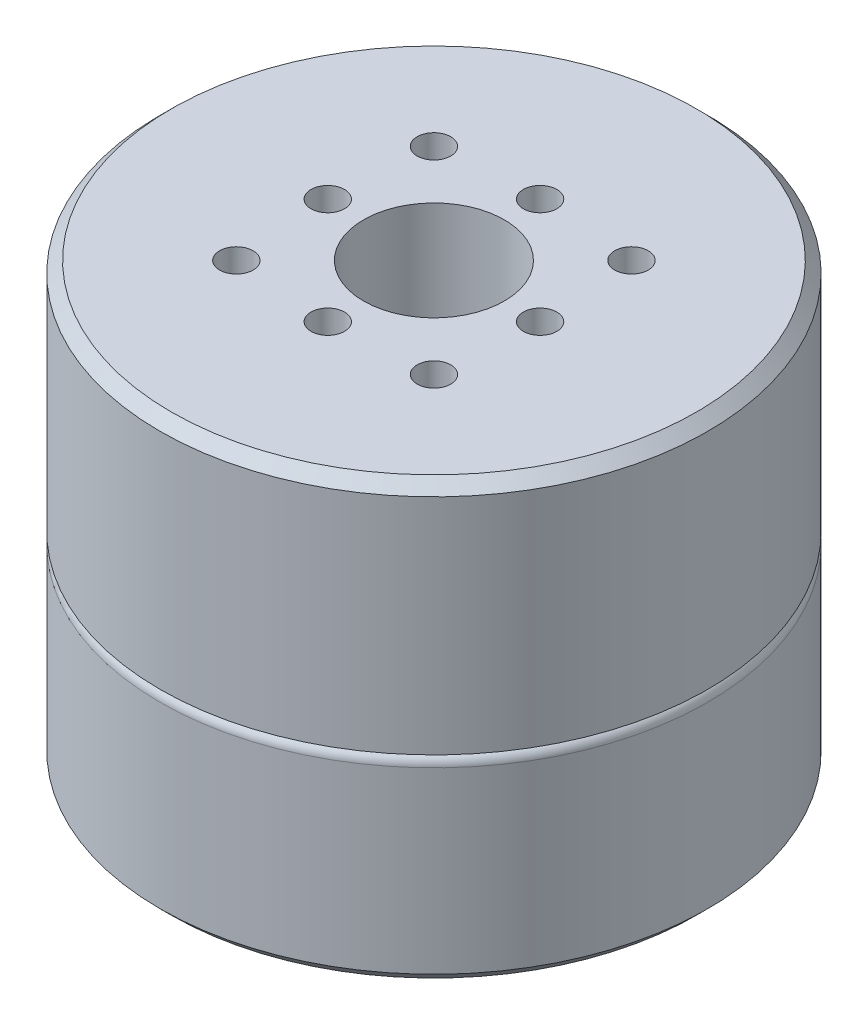
ISO-10303-21;
HEADER;
FILE_DESCRIPTION(('STEP AP214'),'2;1');
FILE_NAME('part.step','',(''),(''),'','','');
FILE_SCHEMA(('AUTOMOTIVE_DESIGN { 1 0 10303 214 1 1 1 1 }'));
ENDSEC;
DATA;
#1=APPLICATION_CONTEXT('core data for automotive mechanical design processes');
#2=APPLICATION_PROTOCOL_DEFINITION('international standard','automotive_design',2000,#1);
#3=PRODUCT_CONTEXT('',#1,'mechanical');
#4=PRODUCT('Part','Part','',(#3));
#5=PRODUCT_RELATED_PRODUCT_CATEGORY('part','',(#4));
#6=PRODUCT_DEFINITION_FORMATION('','',#4);
#7=PRODUCT_DEFINITION_CONTEXT('part definition',#1,'design');
#8=PRODUCT_DEFINITION('design','',#6,#7);
#9=PRODUCT_DEFINITION_SHAPE('','',#8);
#10=(LENGTH_UNIT() NAMED_UNIT(*) SI_UNIT(.MILLI.,.METRE.));
#11=(NAMED_UNIT(*) PLANE_ANGLE_UNIT() SI_UNIT($,.RADIAN.));
#12=(NAMED_UNIT(*) SI_UNIT($,.STERADIAN.) SOLID_ANGLE_UNIT());
#13=UNCERTAINTY_MEASURE_WITH_UNIT(LENGTH_MEASURE(1.E-05),#10,'distance_accuracy_value','');
#14=(GEOMETRIC_REPRESENTATION_CONTEXT(3) GLOBAL_UNCERTAINTY_ASSIGNED_CONTEXT((#13)) GLOBAL_UNIT_ASSIGNED_CONTEXT((#10,
#11,#12)) REPRESENTATION_CONTEXT('',''));
#15=CARTESIAN_POINT('',(0.,0.,0.));
#16=DIRECTION('',(0.,0.,1.));
#17=DIRECTION('',(1.,0.,0.));
#18=AXIS2_PLACEMENT_3D('',#15,#16,#17);
#19=CARTESIAN_POINT('',(0.,18.,0.));
#20=DIRECTION('',(0.,-1.,0.));
#21=DIRECTION('',(0.,0.,-1.));
#22=AXIS2_PLACEMENT_3D('',#19,#20,#21);
#23=CYLINDRICAL_SURFACE('',#22,24.5);
#24=CARTESIAN_POINT('',(0.,1.,0.));
#25=DIRECTION('',(0.,1.,0.));
#26=DIRECTION('',(0.,0.,1.));
#27=AXIS2_PLACEMENT_3D('',#24,#25,#26);
#28=CIRCLE('',#27,24.5);
#29=CARTESIAN_POINT('',(0.,1.,24.5));
#30=VERTEX_POINT('',#29);
#31=EDGE_CURVE('E44',#30,#30,#28,.T.);
#32=ORIENTED_EDGE('',*,*,#31,.T.);
#33=EDGE_LOOP('',(#32));
#34=FACE_BOUND('',#33,.T.);
#35=CARTESIAN_POINT('',(0.,17.,0.));
#36=DIRECTION('',(0.,1.,0.));
#37=DIRECTION('',(0.,0.,1.));
#38=AXIS2_PLACEMENT_3D('',#35,#36,#37);
#39=CIRCLE('',#38,24.5);
#40=CARTESIAN_POINT('',(0.,17.,24.5));
#41=VERTEX_POINT('',#40);
#42=EDGE_CURVE('E57',#41,#41,#39,.F.);
#43=ORIENTED_EDGE('',*,*,#42,.T.);
#44=EDGE_LOOP('',(#43));
#45=FACE_BOUND('',#44,.T.);
#46=ADVANCED_FACE('F36',(#34,#45),#23,.T.);
#47=CARTESIAN_POINT('',(0.,0.,0.));
#48=DIRECTION('',(0.,1.,0.));
#49=DIRECTION('',(0.,0.,1.));
#50=AXIS2_PLACEMENT_3D('',#47,#48,#49);
#51=PLANE('',#50);
#52=CARTESIAN_POINT('',(15.,0.,0.));
#53=DIRECTION('',(0.,-1.,0.));
#54=DIRECTION('',(0.,0.,-1.));
#55=AXIS2_PLACEMENT_3D('',#52,#53,#54);
#56=CIRCLE('',#55,1.5);
#57=CARTESIAN_POINT('',(15.,0.,-1.5));
#58=VERTEX_POINT('',#57);
#59=EDGE_CURVE('E139',#58,#58,#56,.T.);
#60=ORIENTED_EDGE('',*,*,#59,.F.);
#61=EDGE_LOOP('',(#60));
#62=FACE_BOUND('',#61,.T.);
#63=CARTESIAN_POINT('',(0.,0.,-15.));
#64=DIRECTION('',(0.,-1.,0.));
#65=DIRECTION('',(0.,0.,-1.));
#66=AXIS2_PLACEMENT_3D('',#63,#64,#65);
#67=CIRCLE('',#66,1.5);
#68=CARTESIAN_POINT('',(0.,0.,-16.5));
#69=VERTEX_POINT('',#68);
#70=EDGE_CURVE('E133',#69,#69,#67,.T.);
#71=ORIENTED_EDGE('',*,*,#70,.F.);
#72=EDGE_LOOP('',(#71));
#73=FACE_BOUND('',#72,.T.);
#74=CARTESIAN_POINT('',(-15.,0.,1.04744440165294E-13));
#75=DIRECTION('',(0.,-1.,0.));
#76=DIRECTION('',(0.,0.,-1.));
#77=AXIS2_PLACEMENT_3D('',#74,#75,#76);
#78=CIRCLE('',#77,1.5);
#79=CARTESIAN_POINT('',(-15.,0.,-1.4999999999999));
#80=VERTEX_POINT('',#79);
#81=EDGE_CURVE('E127',#80,#80,#78,.T.);
#82=ORIENTED_EDGE('',*,*,#81,.F.);
#83=EDGE_LOOP('',(#82));
#84=FACE_BOUND('',#83,.T.);
#85=CARTESIAN_POINT('',(1.57116660247941E-13,0.,15.));
#86=DIRECTION('',(0.,-1.,0.));
#87=DIRECTION('',(0.,0.,-1.));
#88=AXIS2_PLACEMENT_3D('',#85,#86,#87);
#89=CIRCLE('',#88,1.5);
#90=CARTESIAN_POINT('',(1.57116660247941E-13,0.,13.5));
#91=VERTEX_POINT('',#90);
#92=EDGE_CURVE('E121',#91,#91,#89,.T.);
#93=ORIENTED_EDGE('',*,*,#92,.F.);
#94=EDGE_LOOP('',(#93));
#95=FACE_BOUND('',#94,.T.);
#96=CARTESIAN_POINT('',(0.,0.,0.));
#97=DIRECTION('',(0.,1.,0.));
#98=DIRECTION('',(0.,0.,1.));
#99=AXIS2_PLACEMENT_3D('',#96,#97,#98);
#100=CIRCLE('',#99,23.5);
#101=CARTESIAN_POINT('',(0.,0.,23.5));
#102=VERTEX_POINT('',#101);
#103=EDGE_CURVE('E10',#102,#102,#100,.F.);
#104=ORIENTED_EDGE('',*,*,#103,.T.);
#105=EDGE_LOOP('',(#104));
#106=FACE_BOUND('',#105,.T.);
#107=ADVANCED_FACE('F154',(#62,#73,#84,#95,#106),#51,.F.);
#108=CARTESIAN_POINT('',(0.,17.,0.));
#109=DIRECTION('',(0.,1.,0.));
#110=DIRECTION('',(0.,0.,1.));
#111=AXIS2_PLACEMENT_3D('',#108,#109,#110);
#112=TOROIDAL_SURFACE('',#111,23.5,1.);
#113=ORIENTED_EDGE('',*,*,#42,.F.);
#114=EDGE_LOOP('',(#113));
#115=FACE_BOUND('',#114,.T.);
#116=CARTESIAN_POINT('',(0.,18.,0.));
#117=DIRECTION('',(0.,1.,0.));
#118=DIRECTION('',(0.,0.,1.));
#119=AXIS2_PLACEMENT_3D('',#116,#117,#118);
#120=CIRCLE('',#119,23.5);
#121=CARTESIAN_POINT('',(0.,18.,23.5));
#122=VERTEX_POINT('',#121);
#123=EDGE_CURVE('E60',#122,#122,#120,.T.);
#124=ORIENTED_EDGE('',*,*,#123,.F.);
#125=EDGE_LOOP('',(#124));
#126=FACE_BOUND('',#125,.T.);
#127=ADVANCED_FACE('F157',(#115,#126),#112,.T.);
#128=CARTESIAN_POINT('',(0.,39.,0.));
#129=DIRECTION('',(0.,-1.,0.));
#130=DIRECTION('',(0.,0.,-1.));
#131=AXIS2_PLACEMENT_3D('',#128,#129,#130);
#132=CYLINDRICAL_SURFACE('',#131,24.5);
#133=CARTESIAN_POINT('',(0.,38.,0.));
#134=DIRECTION('',(0.,1.,0.));
#135=DIRECTION('',(0.,0.,1.));
#136=AXIS2_PLACEMENT_3D('',#133,#134,#135);
#137=CIRCLE('',#136,24.5);
#138=CARTESIAN_POINT('',(0.,38.,24.5));
#139=VERTEX_POINT('',#138);
#140=EDGE_CURVE('E48',#139,#139,#137,.F.);
#141=ORIENTED_EDGE('',*,*,#140,.T.);
#142=EDGE_LOOP('',(#141));
#143=FACE_BOUND('',#142,.T.);
#144=CARTESIAN_POINT('',(0.,18.,0.));
#145=DIRECTION('',(0.,1.,0.));
#146=DIRECTION('',(0.,0.,1.));
#147=AXIS2_PLACEMENT_3D('',#144,#145,#146);
#148=CIRCLE('',#147,24.5);
#149=CARTESIAN_POINT('',(0.,18.,24.5));
#150=VERTEX_POINT('',#149);
#151=EDGE_CURVE('E63',#150,#150,#148,.T.);
#152=ORIENTED_EDGE('',*,*,#151,.T.);
#153=EDGE_LOOP('',(#152));
#154=FACE_BOUND('',#153,.T.);
#155=ADVANCED_FACE('F191',(#143,#154),#132,.T.);
#156=CARTESIAN_POINT('',(0.,39.,0.));
#157=DIRECTION('',(0.,1.,0.));
#158=DIRECTION('',(0.,0.,1.));
#159=AXIS2_PLACEMENT_3D('',#156,#157,#158);
#160=PLANE('',#159);
#161=CARTESIAN_POINT('',(0.,39.,9.5));
#162=DIRECTION('',(0.,1.,0.));
#163=DIRECTION('',(0.,0.,1.));
#164=AXIS2_PLACEMENT_3D('',#161,#162,#163);
#165=CIRCLE('',#164,1.5);
#166=CARTESIAN_POINT('',(0.,39.,11.));
#167=VERTEX_POINT('',#166);
#168=EDGE_CURVE('E98',#167,#167,#165,.T.);
#169=ORIENTED_EDGE('',*,*,#168,.F.);
#170=EDGE_LOOP('',(#169));
#171=FACE_BOUND('',#170,.T.);
#172=CARTESIAN_POINT('',(-9.5,39.,0.));
#173=DIRECTION('',(0.,1.,0.));
#174=DIRECTION('',(0.,0.,1.));
#175=AXIS2_PLACEMENT_3D('',#172,#173,#174);
#176=CIRCLE('',#175,1.5);
#177=CARTESIAN_POINT('',(-9.5,39.,1.49999999999993));
#178=VERTEX_POINT('',#177);
#179=EDGE_CURVE('E92',#178,#178,#176,.T.);
#180=ORIENTED_EDGE('',*,*,#179,.F.);
#181=EDGE_LOOP('',(#180));
#182=FACE_BOUND('',#181,.T.);
#183=CARTESIAN_POINT('',(0.,39.,-9.5));
#184=DIRECTION('',(0.,1.,0.));
#185=DIRECTION('',(0.,0.,1.));
#186=AXIS2_PLACEMENT_3D('',#183,#184,#185);
#187=CIRCLE('',#186,1.5);
#188=CARTESIAN_POINT('',(0.,39.,-8.));
#189=VERTEX_POINT('',#188);
#190=EDGE_CURVE('E86',#189,#189,#187,.T.);
#191=ORIENTED_EDGE('',*,*,#190,.F.);
#192=EDGE_LOOP('',(#191));
#193=FACE_BOUND('',#192,.T.);
#194=CARTESIAN_POINT('',(8.83883476483195,39.,-8.83883476483174));
#195=DIRECTION('',(0.,1.,0.));
#196=DIRECTION('',(0.,0.,1.));
#197=AXIS2_PLACEMENT_3D('',#194,#195,#196);
#198=CIRCLE('',#197,1.5);
#199=CARTESIAN_POINT('',(8.83883476483195,39.,-7.33883476483174));
#200=VERTEX_POINT('',#199);
#201=EDGE_CURVE('E79',#200,#200,#198,.T.);
#202=ORIENTED_EDGE('',*,*,#201,.F.);
#203=EDGE_LOOP('',(#202));
#204=FACE_BOUND('',#203,.T.);
#205=CARTESIAN_POINT('',(8.83883476483235,39.,8.83883476483184));
#206=DIRECTION('',(0.,1.,0.));
#207=DIRECTION('',(0.,0.,1.));
#208=AXIS2_PLACEMENT_3D('',#205,#206,#207);
#209=CIRCLE('',#208,1.49999999999995);
#210=CARTESIAN_POINT('',(8.83883476483235,39.,10.3388347648318));
#211=VERTEX_POINT('',#210);
#212=EDGE_CURVE('E116',#211,#211,#209,.T.);
#213=ORIENTED_EDGE('',*,*,#212,.F.);
#214=EDGE_LOOP('',(#213));
#215=FACE_BOUND('',#214,.T.);
#216=CARTESIAN_POINT('',(-8.83883476483134,39.,8.83883476483235));
#217=DIRECTION('',(0.,1.,0.));
#218=DIRECTION('',(0.,0.,1.));
#219=AXIS2_PLACEMENT_3D('',#216,#217,#218);
#220=CIRCLE('',#219,1.50000000000045);
#221=CARTESIAN_POINT('',(-8.83883476483134,39.,10.3388347648328));
#222=VERTEX_POINT('',#221);
#223=EDGE_CURVE('E110',#222,#222,#220,.T.);
#224=ORIENTED_EDGE('',*,*,#223,.F.);
#225=EDGE_LOOP('',(#224));
#226=FACE_BOUND('',#225,.T.);
#227=CARTESIAN_POINT('',(-8.83883476483185,39.,-8.83883476483134));
#228=DIRECTION('',(0.,1.,0.));
#229=DIRECTION('',(0.,0.,1.));
#230=AXIS2_PLACEMENT_3D('',#227,#228,#229);
#231=CIRCLE('',#230,1.50000000000062);
#232=CARTESIAN_POINT('',(-8.83883476483185,39.,-7.33883476483072));
#233=VERTEX_POINT('',#232);
#234=EDGE_CURVE('E103',#233,#233,#231,.T.);
#235=ORIENTED_EDGE('',*,*,#234,.F.);
#236=EDGE_LOOP('',(#235));
#237=FACE_BOUND('',#236,.T.);
#238=CARTESIAN_POINT('',(9.5,39.,0.));
#239=DIRECTION('',(0.,1.,0.));
#240=DIRECTION('',(0.,0.,1.));
#241=AXIS2_PLACEMENT_3D('',#238,#239,#240);
#242=CIRCLE('',#241,1.5);
#243=CARTESIAN_POINT('',(9.5,39.,1.5));
#244=VERTEX_POINT('',#243);
#245=EDGE_CURVE('E73',#244,#244,#242,.T.);
#246=ORIENTED_EDGE('',*,*,#245,.F.);
#247=EDGE_LOOP('',(#246));
#248=FACE_BOUND('',#247,.T.);
#249=CARTESIAN_POINT('',(0.,39.,0.));
#250=DIRECTION('',(0.,1.,0.));
#251=DIRECTION('',(0.,0.,1.));
#252=AXIS2_PLACEMENT_3D('',#249,#250,#251);
#253=CIRCLE('',#252,6.3);
#254=CARTESIAN_POINT('',(0.,39.,6.3));
#255=VERTEX_POINT('',#254);
#256=EDGE_CURVE('E67',#255,#255,#253,.T.);
#257=ORIENTED_EDGE('',*,*,#256,.F.);
#258=EDGE_LOOP('',(#257));
#259=FACE_BOUND('',#258,.T.);
#260=CARTESIAN_POINT('',(0.,39.,0.));
#261=DIRECTION('',(0.,1.,0.));
#262=DIRECTION('',(0.,0.,1.));
#263=AXIS2_PLACEMENT_3D('',#260,#261,#262);
#264=CIRCLE('',#263,23.5);
#265=CARTESIAN_POINT('',(0.,39.,23.5));
#266=VERTEX_POINT('',#265);
#267=EDGE_CURVE('E52',#266,#266,#264,.T.);
#268=ORIENTED_EDGE('',*,*,#267,.T.);
#269=EDGE_LOOP('',(#268));
#270=FACE_BOUND('',#269,.T.);
#271=ADVANCED_FACE('F206',(#171,#182,#193,#204,#215,#226,#237,#248,#259,#270),#160,.T.);
#272=CARTESIAN_POINT('',(0.,18.,0.));
#273=DIRECTION('',(0.,1.,0.));
#274=DIRECTION('',(0.,0.,1.));
#275=AXIS2_PLACEMENT_3D('',#272,#273,#274);
#276=PLANE('',#275);
#277=ORIENTED_EDGE('',*,*,#123,.T.);
#278=EDGE_LOOP('',(#277));
#279=FACE_BOUND('',#278,.T.);
#280=ORIENTED_EDGE('',*,*,#151,.F.);
#281=EDGE_LOOP('',(#280));
#282=FACE_BOUND('',#281,.T.);
#283=ADVANCED_FACE('F198',(#279,#282),#276,.F.);
#284=CARTESIAN_POINT('',(0.,39.,0.));
#285=DIRECTION('',(0.,-1.,0.));
#286=DIRECTION('',(0.,0.,-1.));
#287=AXIS2_PLACEMENT_3D('',#284,#285,#286);
#288=CONICAL_SURFACE('',#287,23.5,0.785398163397443);
#289=ORIENTED_EDGE('',*,*,#140,.F.);
#290=EDGE_LOOP('',(#289));
#291=FACE_BOUND('',#290,.T.);
#292=ORIENTED_EDGE('',*,*,#267,.F.);
#293=EDGE_LOOP('',(#292));
#294=FACE_BOUND('',#293,.T.);
#295=ADVANCED_FACE('F194',(#291,#294),#288,.T.);
#296=CARTESIAN_POINT('',(0.,1.,0.));
#297=DIRECTION('',(0.,1.,0.));
#298=DIRECTION('',(0.,0.,1.));
#299=AXIS2_PLACEMENT_3D('',#296,#297,#298);
#300=CONICAL_SURFACE('',#299,24.5,0.785398163397448);
#301=ORIENTED_EDGE('',*,*,#103,.F.);
#302=EDGE_LOOP('',(#301));
#303=FACE_BOUND('',#302,.T.);
#304=ORIENTED_EDGE('',*,*,#31,.F.);
#305=EDGE_LOOP('',(#304));
#306=FACE_BOUND('',#305,.T.);
#307=ADVANCED_FACE('F39',(#303,#306),#300,.T.);
#308=CARTESIAN_POINT('',(0.,29.,0.));
#309=DIRECTION('',(0.,1.,0.));
#310=DIRECTION('',(0.,0.,1.));
#311=AXIS2_PLACEMENT_3D('',#308,#309,#310);
#312=CYLINDRICAL_SURFACE('',#311,6.3);
#313=CARTESIAN_POINT('',(0.,29.,0.));
#314=DIRECTION('',(0.,1.,0.));
#315=DIRECTION('',(0.,0.,1.));
#316=AXIS2_PLACEMENT_3D('',#313,#314,#315);
#317=CIRCLE('',#316,6.3);
#318=CARTESIAN_POINT('',(0.,29.,6.3));
#319=VERTEX_POINT('',#318);
#320=EDGE_CURVE('E66',#319,#319,#317,.T.);
#321=ORIENTED_EDGE('',*,*,#320,.F.);
#322=EDGE_LOOP('',(#321));
#323=FACE_BOUND('',#322,.T.);
#324=ORIENTED_EDGE('',*,*,#256,.T.);
#325=EDGE_LOOP('',(#324));
#326=FACE_BOUND('',#325,.T.);
#327=ADVANCED_FACE('F204',(#323,#326),#312,.F.);
#328=CARTESIAN_POINT('',(0.,29.,0.));
#329=DIRECTION('',(0.,1.,0.));
#330=DIRECTION('',(0.,0.,1.));
#331=AXIS2_PLACEMENT_3D('',#328,#329,#330);
#332=PLANE('',#331);
#333=ORIENTED_EDGE('',*,*,#320,.T.);
#334=EDGE_LOOP('',(#333));
#335=FACE_BOUND('',#334,.T.);
#336=ADVANCED_FACE('F225',(#335),#332,.T.);
#337=CARTESIAN_POINT('',(9.5,34.,0.));
#338=DIRECTION('',(0.,1.,0.));
#339=DIRECTION('',(0.,0.,1.));
#340=AXIS2_PLACEMENT_3D('',#337,#338,#339);
#341=CYLINDRICAL_SURFACE('',#340,1.5);
#342=CARTESIAN_POINT('',(9.5,34.,0.));
#343=DIRECTION('',(0.,1.,0.));
#344=DIRECTION('',(0.,0.,1.));
#345=AXIS2_PLACEMENT_3D('',#342,#343,#344);
#346=CIRCLE('',#345,1.5);
#347=CARTESIAN_POINT('',(9.5,34.,1.5));
#348=VERTEX_POINT('',#347);
#349=EDGE_CURVE('E70',#348,#348,#346,.T.);
#350=ORIENTED_EDGE('',*,*,#349,.F.);
#351=EDGE_LOOP('',(#350));
#352=FACE_BOUND('',#351,.T.);
#353=ORIENTED_EDGE('',*,*,#245,.T.);
#354=EDGE_LOOP('',(#353));
#355=FACE_BOUND('',#354,.T.);
#356=ADVANCED_FACE('F229',(#352,#355),#341,.F.);
#357=CARTESIAN_POINT('',(9.5,34.,0.));
#358=DIRECTION('',(0.,1.,0.));
#359=DIRECTION('',(0.,0.,1.));
#360=AXIS2_PLACEMENT_3D('',#357,#358,#359);
#361=PLANE('',#360);
#362=ORIENTED_EDGE('',*,*,#349,.T.);
#363=EDGE_LOOP('',(#362));
#364=FACE_BOUND('',#363,.T.);
#365=ADVANCED_FACE('F233',(#364),#361,.T.);
#366=CARTESIAN_POINT('',(-8.83883476483185,34.,-8.83883476483134));
#367=DIRECTION('',(0.,1.,0.));
#368=DIRECTION('',(0.,0.,1.));
#369=AXIS2_PLACEMENT_3D('',#366,#367,#368);
#370=CYLINDRICAL_SURFACE('',#369,1.50000000000062);
#371=CARTESIAN_POINT('',(-8.83883476483185,34.,-8.83883476483134));
#372=DIRECTION('',(0.,1.,0.));
#373=DIRECTION('',(0.,0.,1.));
#374=AXIS2_PLACEMENT_3D('',#371,#372,#373);
#375=CIRCLE('',#374,1.50000000000062);
#376=CARTESIAN_POINT('',(-8.83883476483185,34.,-7.33883476483072));
#377=VERTEX_POINT('',#376);
#378=EDGE_CURVE('E106',#377,#377,#375,.T.);
#379=ORIENTED_EDGE('',*,*,#378,.F.);
#380=EDGE_LOOP('',(#379));
#381=FACE_BOUND('',#380,.T.);
#382=ORIENTED_EDGE('',*,*,#234,.T.);
#383=EDGE_LOOP('',(#382));
#384=FACE_BOUND('',#383,.T.);
#385=ADVANCED_FACE('F237',(#381,#384),#370,.F.);
#386=CARTESIAN_POINT('',(-8.83883476483185,34.,-8.83883476483134));
#387=DIRECTION('',(0.,1.,0.));
#388=DIRECTION('',(0.,0.,1.));
#389=AXIS2_PLACEMENT_3D('',#386,#387,#388);
#390=PLANE('',#389);
#391=ORIENTED_EDGE('',*,*,#378,.T.);
#392=EDGE_LOOP('',(#391));
#393=FACE_BOUND('',#392,.T.);
#394=ADVANCED_FACE('F269',(#393),#390,.T.);
#395=CARTESIAN_POINT('',(-8.83883476483134,34.,8.83883476483235));
#396=DIRECTION('',(0.,1.,0.));
#397=DIRECTION('',(0.,0.,1.));
#398=AXIS2_PLACEMENT_3D('',#395,#396,#397);
#399=CYLINDRICAL_SURFACE('',#398,1.50000000000045);
#400=CARTESIAN_POINT('',(-8.83883476483134,34.,8.83883476483235));
#401=DIRECTION('',(0.,1.,0.));
#402=DIRECTION('',(0.,0.,1.));
#403=AXIS2_PLACEMENT_3D('',#400,#401,#402);
#404=CIRCLE('',#403,1.50000000000045);
#405=CARTESIAN_POINT('',(-8.83883476483134,34.,10.3388347648328));
#406=VERTEX_POINT('',#405);
#407=EDGE_CURVE('E113',#406,#406,#404,.T.);
#408=ORIENTED_EDGE('',*,*,#407,.F.);
#409=EDGE_LOOP('',(#408));
#410=FACE_BOUND('',#409,.T.);
#411=ORIENTED_EDGE('',*,*,#223,.T.);
#412=EDGE_LOOP('',(#411));
#413=FACE_BOUND('',#412,.T.);
#414=ADVANCED_FACE('F273',(#410,#413),#399,.F.);
#415=CARTESIAN_POINT('',(-8.83883476483134,34.,8.83883476483235));
#416=DIRECTION('',(0.,1.,0.));
#417=DIRECTION('',(0.,0.,1.));
#418=AXIS2_PLACEMENT_3D('',#415,#416,#417);
#419=PLANE('',#418);
#420=ORIENTED_EDGE('',*,*,#407,.T.);
#421=EDGE_LOOP('',(#420));
#422=FACE_BOUND('',#421,.T.);
#423=ADVANCED_FACE('F277',(#422),#419,.T.);
#424=CARTESIAN_POINT('',(8.83883476483235,34.,8.83883476483184));
#425=DIRECTION('',(0.,1.,0.));
#426=DIRECTION('',(0.,0.,1.));
#427=AXIS2_PLACEMENT_3D('',#424,#425,#426);
#428=CYLINDRICAL_SURFACE('',#427,1.49999999999995);
#429=CARTESIAN_POINT('',(8.83883476483235,34.,8.83883476483184));
#430=DIRECTION('',(0.,1.,0.));
#431=DIRECTION('',(0.,0.,1.));
#432=AXIS2_PLACEMENT_3D('',#429,#430,#431);
#433=CIRCLE('',#432,1.49999999999995);
#434=CARTESIAN_POINT('',(8.83883476483235,34.,10.3388347648318));
#435=VERTEX_POINT('',#434);
#436=EDGE_CURVE('E83',#435,#435,#433,.T.);
#437=ORIENTED_EDGE('',*,*,#436,.F.);
#438=EDGE_LOOP('',(#437));
#439=FACE_BOUND('',#438,.T.);
#440=ORIENTED_EDGE('',*,*,#212,.T.);
#441=EDGE_LOOP('',(#440));
#442=FACE_BOUND('',#441,.T.);
#443=ADVANCED_FACE('F281',(#439,#442),#428,.F.);
#444=CARTESIAN_POINT('',(8.83883476483235,34.,8.83883476483184));
#445=DIRECTION('',(0.,1.,0.));
#446=DIRECTION('',(0.,0.,1.));
#447=AXIS2_PLACEMENT_3D('',#444,#445,#446);
#448=PLANE('',#447);
#449=ORIENTED_EDGE('',*,*,#436,.T.);
#450=EDGE_LOOP('',(#449));
#451=FACE_BOUND('',#450,.T.);
#452=ADVANCED_FACE('F243',(#451),#448,.T.);
#453=CARTESIAN_POINT('',(8.83883476483195,34.,-8.83883476483174));
#454=DIRECTION('',(0.,1.,0.));
#455=DIRECTION('',(0.,0.,1.));
#456=AXIS2_PLACEMENT_3D('',#453,#454,#455);
#457=CYLINDRICAL_SURFACE('',#456,1.5);
#458=CARTESIAN_POINT('',(8.83883476483195,34.,-8.83883476483174));
#459=DIRECTION('',(0.,1.,0.));
#460=DIRECTION('',(0.,0.,1.));
#461=AXIS2_PLACEMENT_3D('',#458,#459,#460);
#462=CIRCLE('',#461,1.5);
#463=CARTESIAN_POINT('',(8.83883476483195,34.,-7.33883476483174));
#464=VERTEX_POINT('',#463);
#465=EDGE_CURVE('E82',#464,#464,#462,.T.);
#466=ORIENTED_EDGE('',*,*,#465,.F.);
#467=EDGE_LOOP('',(#466));
#468=FACE_BOUND('',#467,.T.);
#469=ORIENTED_EDGE('',*,*,#201,.T.);
#470=EDGE_LOOP('',(#469));
#471=FACE_BOUND('',#470,.T.);
#472=ADVANCED_FACE('F239',(#468,#471),#457,.F.);
#473=CARTESIAN_POINT('',(8.83883476483195,34.,-8.83883476483174));
#474=DIRECTION('',(0.,1.,0.));
#475=DIRECTION('',(0.,0.,1.));
#476=AXIS2_PLACEMENT_3D('',#473,#474,#475);
#477=PLANE('',#476);
#478=ORIENTED_EDGE('',*,*,#465,.T.);
#479=EDGE_LOOP('',(#478));
#480=FACE_BOUND('',#479,.T.);
#481=ADVANCED_FACE('F242',(#480),#477,.T.);
#482=CARTESIAN_POINT('',(0.,34.,-9.5));
#483=DIRECTION('',(0.,1.,0.));
#484=DIRECTION('',(0.,0.,1.));
#485=AXIS2_PLACEMENT_3D('',#482,#483,#484);
#486=CYLINDRICAL_SURFACE('',#485,1.5);
#487=CARTESIAN_POINT('',(0.,34.,-9.5));
#488=DIRECTION('',(0.,1.,0.));
#489=DIRECTION('',(0.,0.,1.));
#490=AXIS2_PLACEMENT_3D('',#487,#488,#489);
#491=CIRCLE('',#490,1.5);
#492=CARTESIAN_POINT('',(0.,34.,-8.));
#493=VERTEX_POINT('',#492);
#494=EDGE_CURVE('E89',#493,#493,#491,.T.);
#495=ORIENTED_EDGE('',*,*,#494,.F.);
#496=EDGE_LOOP('',(#495));
#497=FACE_BOUND('',#496,.T.);
#498=ORIENTED_EDGE('',*,*,#190,.T.);
#499=EDGE_LOOP('',(#498));
#500=FACE_BOUND('',#499,.T.);
#501=ADVANCED_FACE('F247',(#497,#500),#486,.F.);
#502=CARTESIAN_POINT('',(0.,34.,-9.5));
#503=DIRECTION('',(0.,1.,0.));
#504=DIRECTION('',(0.,0.,1.));
#505=AXIS2_PLACEMENT_3D('',#502,#503,#504);
#506=PLANE('',#505);
#507=ORIENTED_EDGE('',*,*,#494,.T.);
#508=EDGE_LOOP('',(#507));
#509=FACE_BOUND('',#508,.T.);
#510=ADVANCED_FACE('F251',(#509),#506,.T.);
#511=CARTESIAN_POINT('',(-9.5,34.,0.));
#512=DIRECTION('',(0.,1.,0.));
#513=DIRECTION('',(0.,0.,1.));
#514=AXIS2_PLACEMENT_3D('',#511,#512,#513);
#515=CYLINDRICAL_SURFACE('',#514,1.5);
#516=CARTESIAN_POINT('',(-9.5,34.,0.));
#517=DIRECTION('',(0.,1.,0.));
#518=DIRECTION('',(0.,0.,1.));
#519=AXIS2_PLACEMENT_3D('',#516,#517,#518);
#520=CIRCLE('',#519,1.5);
#521=CARTESIAN_POINT('',(-9.5,34.,1.49999999999993));
#522=VERTEX_POINT('',#521);
#523=EDGE_CURVE('E95',#522,#522,#520,.T.);
#524=ORIENTED_EDGE('',*,*,#523,.F.);
#525=EDGE_LOOP('',(#524));
#526=FACE_BOUND('',#525,.T.);
#527=ORIENTED_EDGE('',*,*,#179,.T.);
#528=EDGE_LOOP('',(#527));
#529=FACE_BOUND('',#528,.T.);
#530=ADVANCED_FACE('F255',(#526,#529),#515,.F.);
#531=CARTESIAN_POINT('',(-9.5,34.,0.));
#532=DIRECTION('',(0.,1.,0.));
#533=DIRECTION('',(0.,0.,1.));
#534=AXIS2_PLACEMENT_3D('',#531,#532,#533);
#535=PLANE('',#534);
#536=ORIENTED_EDGE('',*,*,#523,.T.);
#537=EDGE_LOOP('',(#536));
#538=FACE_BOUND('',#537,.T.);
#539=ADVANCED_FACE('F259',(#538),#535,.T.);
#540=CARTESIAN_POINT('',(0.,34.,9.5));
#541=DIRECTION('',(0.,1.,0.));
#542=DIRECTION('',(0.,0.,1.));
#543=AXIS2_PLACEMENT_3D('',#540,#541,#542);
#544=CYLINDRICAL_SURFACE('',#543,1.5);
#545=CARTESIAN_POINT('',(0.,34.,9.5));
#546=DIRECTION('',(0.,1.,0.));
#547=DIRECTION('',(0.,0.,1.));
#548=AXIS2_PLACEMENT_3D('',#545,#546,#547);
#549=CIRCLE('',#548,1.5);
#550=CARTESIAN_POINT('',(0.,34.,11.));
#551=VERTEX_POINT('',#550);
#552=EDGE_CURVE('E76',#551,#551,#549,.T.);
#553=ORIENTED_EDGE('',*,*,#552,.F.);
#554=EDGE_LOOP('',(#553));
#555=FACE_BOUND('',#554,.T.);
#556=ORIENTED_EDGE('',*,*,#168,.T.);
#557=EDGE_LOOP('',(#556));
#558=FACE_BOUND('',#557,.T.);
#559=ADVANCED_FACE('F178',(#555,#558),#544,.F.);
#560=CARTESIAN_POINT('',(0.,34.,9.5));
#561=DIRECTION('',(0.,1.,0.));
#562=DIRECTION('',(0.,0.,1.));
#563=AXIS2_PLACEMENT_3D('',#560,#561,#562);
#564=PLANE('',#563);
#565=ORIENTED_EDGE('',*,*,#552,.T.);
#566=EDGE_LOOP('',(#565));
#567=FACE_BOUND('',#566,.T.);
#568=ADVANCED_FACE('F168',(#567),#564,.T.);
#569=CARTESIAN_POINT('',(1.57116660247941E-13,5.,15.));
#570=DIRECTION('',(0.,-1.,0.));
#571=DIRECTION('',(0.,0.,-1.));
#572=AXIS2_PLACEMENT_3D('',#569,#570,#571);
#573=CYLINDRICAL_SURFACE('',#572,1.5);
#574=CARTESIAN_POINT('',(1.57116660247941E-13,5.,15.));
#575=DIRECTION('',(0.,-1.,0.));
#576=DIRECTION('',(0.,0.,-1.));
#577=AXIS2_PLACEMENT_3D('',#574,#575,#576);
#578=CIRCLE('',#577,1.5);
#579=CARTESIAN_POINT('',(1.57116660247941E-13,5.,13.5));
#580=VERTEX_POINT('',#579);
#581=EDGE_CURVE('E124',#580,#580,#578,.T.);
#582=ORIENTED_EDGE('',*,*,#581,.F.);
#583=EDGE_LOOP('',(#582));
#584=FACE_BOUND('',#583,.T.);
#585=ORIENTED_EDGE('',*,*,#92,.T.);
#586=EDGE_LOOP('',(#585));
#587=FACE_BOUND('',#586,.T.);
#588=ADVANCED_FACE('F165',(#584,#587),#573,.F.);
#589=CARTESIAN_POINT('',(1.57116660247941E-13,5.,15.));
#590=DIRECTION('',(0.,-1.,0.));
#591=DIRECTION('',(0.,0.,-1.));
#592=AXIS2_PLACEMENT_3D('',#589,#590,#591);
#593=PLANE('',#592);
#594=ORIENTED_EDGE('',*,*,#581,.T.);
#595=EDGE_LOOP('',(#594));
#596=FACE_BOUND('',#595,.T.);
#597=ADVANCED_FACE('F167',(#596),#593,.T.);
#598=CARTESIAN_POINT('',(-15.,5.,1.04744440165294E-13));
#599=DIRECTION('',(0.,-1.,0.));
#600=DIRECTION('',(0.,0.,-1.));
#601=AXIS2_PLACEMENT_3D('',#598,#599,#600);
#602=CYLINDRICAL_SURFACE('',#601,1.5);
#603=CARTESIAN_POINT('',(-15.,5.,1.04744440165294E-13));
#604=DIRECTION('',(0.,-1.,0.));
#605=DIRECTION('',(0.,0.,-1.));
#606=AXIS2_PLACEMENT_3D('',#603,#604,#605);
#607=CIRCLE('',#606,1.5);
#608=CARTESIAN_POINT('',(-15.,5.,-1.4999999999999));
#609=VERTEX_POINT('',#608);
#610=EDGE_CURVE('E130',#609,#609,#607,.T.);
#611=ORIENTED_EDGE('',*,*,#610,.F.);
#612=EDGE_LOOP('',(#611));
#613=FACE_BOUND('',#612,.T.);
#614=ORIENTED_EDGE('',*,*,#81,.T.);
#615=EDGE_LOOP('',(#614));
#616=FACE_BOUND('',#615,.T.);
#617=ADVANCED_FACE('F175',(#613,#616),#602,.F.);
#618=CARTESIAN_POINT('',(-15.,5.,1.04744440165294E-13));
#619=DIRECTION('',(0.,-1.,0.));
#620=DIRECTION('',(0.,0.,-1.));
#621=AXIS2_PLACEMENT_3D('',#618,#619,#620);
#622=PLANE('',#621);
#623=ORIENTED_EDGE('',*,*,#610,.T.);
#624=EDGE_LOOP('',(#623));
#625=FACE_BOUND('',#624,.T.);
#626=ADVANCED_FACE('F366',(#625),#622,.T.);
#627=CARTESIAN_POINT('',(0.,5.,-15.));
#628=DIRECTION('',(0.,-1.,0.));
#629=DIRECTION('',(0.,0.,-1.));
#630=AXIS2_PLACEMENT_3D('',#627,#628,#629);
#631=CYLINDRICAL_SURFACE('',#630,1.5);
#632=CARTESIAN_POINT('',(0.,5.,-15.));
#633=DIRECTION('',(0.,-1.,0.));
#634=DIRECTION('',(0.,0.,-1.));
#635=AXIS2_PLACEMENT_3D('',#632,#633,#634);
#636=CIRCLE('',#635,1.5);
#637=CARTESIAN_POINT('',(0.,5.,-16.5));
#638=VERTEX_POINT('',#637);
#639=EDGE_CURVE('E136',#638,#638,#636,.T.);
#640=ORIENTED_EDGE('',*,*,#639,.F.);
#641=EDGE_LOOP('',(#640));
#642=FACE_BOUND('',#641,.T.);
#643=ORIENTED_EDGE('',*,*,#70,.T.);
#644=EDGE_LOOP('',(#643));
#645=FACE_BOUND('',#644,.T.);
#646=ADVANCED_FACE('F376',(#642,#645),#631,.F.);
#647=CARTESIAN_POINT('',(0.,5.,-15.));
#648=DIRECTION('',(0.,-1.,0.));
#649=DIRECTION('',(0.,0.,-1.));
#650=AXIS2_PLACEMENT_3D('',#647,#648,#649);
#651=PLANE('',#650);
#652=ORIENTED_EDGE('',*,*,#639,.T.);
#653=EDGE_LOOP('',(#652));
#654=FACE_BOUND('',#653,.T.);
#655=ADVANCED_FACE('F150',(#654),#651,.T.);
#656=CARTESIAN_POINT('',(15.,5.,0.));
#657=DIRECTION('',(0.,-1.,0.));
#658=DIRECTION('',(0.,0.,-1.));
#659=AXIS2_PLACEMENT_3D('',#656,#657,#658);
#660=CYLINDRICAL_SURFACE('',#659,1.5);
#661=CARTESIAN_POINT('',(15.,5.,0.));
#662=DIRECTION('',(0.,-1.,0.));
#663=DIRECTION('',(0.,0.,-1.));
#664=AXIS2_PLACEMENT_3D('',#661,#662,#663);
#665=CIRCLE('',#664,1.5);
#666=CARTESIAN_POINT('',(15.,5.,-1.5));
#667=VERTEX_POINT('',#666);
#668=EDGE_CURVE('E107',#667,#667,#665,.T.);
#669=ORIENTED_EDGE('',*,*,#668,.F.);
#670=EDGE_LOOP('',(#669));
#671=FACE_BOUND('',#670,.T.);
#672=ORIENTED_EDGE('',*,*,#59,.T.);
#673=EDGE_LOOP('',(#672));
#674=FACE_BOUND('',#673,.T.);
#675=ADVANCED_FACE('F147',(#671,#674),#660,.F.);
#676=CARTESIAN_POINT('',(15.,5.,0.));
#677=DIRECTION('',(0.,-1.,0.));
#678=DIRECTION('',(0.,0.,-1.));
#679=AXIS2_PLACEMENT_3D('',#676,#677,#678);
#680=PLANE('',#679);
#681=ORIENTED_EDGE('',*,*,#668,.T.);
#682=EDGE_LOOP('',(#681));
#683=FACE_BOUND('',#682,.T.);
#684=ADVANCED_FACE('F145',(#683),#680,.T.);
#685=CLOSED_SHELL('',(#46,#107,#127,#155,#271,#283,#295,#307,#327,#336,#356,#365,#385,#394,#414,
#423,#443,#452,#472,#481,#501,#510,#530,#539,#559,#568,#588,#597,#617,#626,#646,#655,#675,#684));
#686=MANIFOLD_SOLID_BREP('B2',#685);
#687=ADVANCED_BREP_SHAPE_REPRESENTATION('',(#18,#686),#14);
#688=SHAPE_DEFINITION_REPRESENTATION(#9,#687);
ENDSEC;
END-ISO-10303-21;
